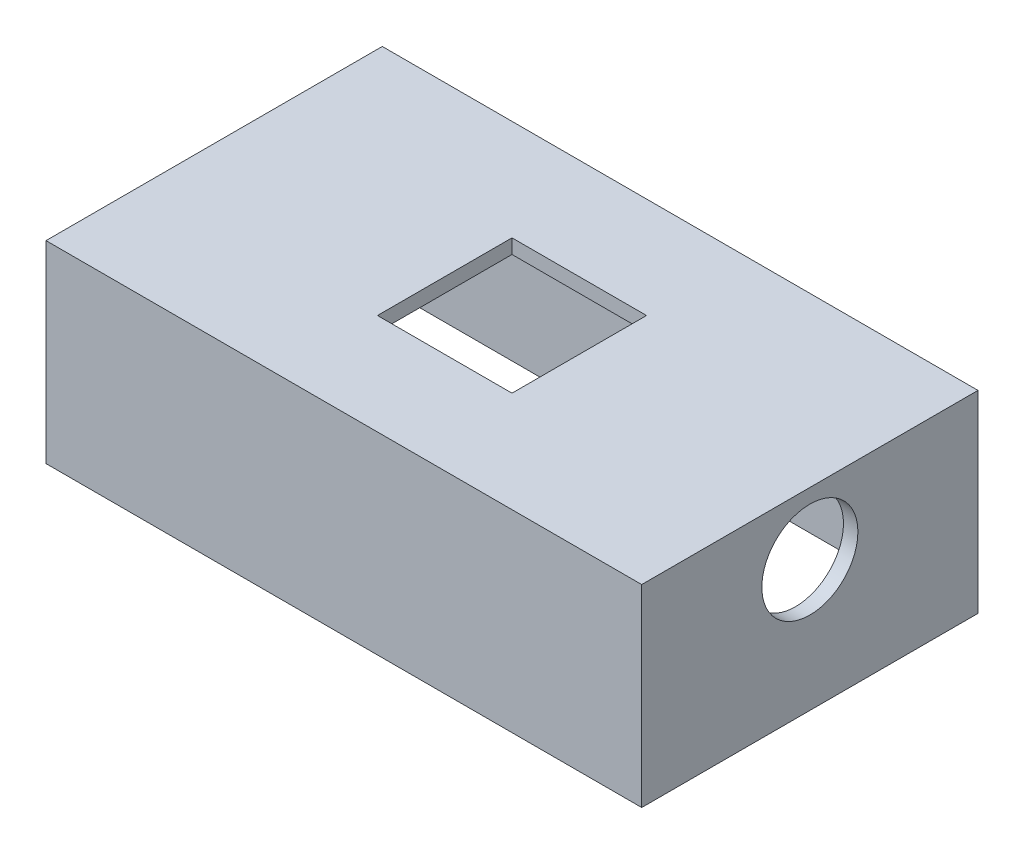
ISO-10303-21;
HEADER;
FILE_DESCRIPTION(('STEP AP214'),'2;1');
FILE_NAME('part.step','',(''),(''),'','','');
FILE_SCHEMA(('AUTOMOTIVE_DESIGN { 1 0 10303 214 1 1 1 1 }'));
ENDSEC;
DATA;
#1=APPLICATION_CONTEXT('core data for automotive mechanical design processes');
#2=APPLICATION_PROTOCOL_DEFINITION('international standard','automotive_design',2000,#1);
#3=PRODUCT_CONTEXT('',#1,'mechanical');
#4=PRODUCT('Part','Part','',(#3));
#5=PRODUCT_RELATED_PRODUCT_CATEGORY('part','',(#4));
#6=PRODUCT_DEFINITION_FORMATION('','',#4);
#7=PRODUCT_DEFINITION_CONTEXT('part definition',#1,'design');
#8=PRODUCT_DEFINITION('design','',#6,#7);
#9=PRODUCT_DEFINITION_SHAPE('','',#8);
#10=(LENGTH_UNIT() NAMED_UNIT(*) SI_UNIT(.MILLI.,.METRE.));
#11=(NAMED_UNIT(*) PLANE_ANGLE_UNIT() SI_UNIT($,.RADIAN.));
#12=(NAMED_UNIT(*) SI_UNIT($,.STERADIAN.) SOLID_ANGLE_UNIT());
#13=UNCERTAINTY_MEASURE_WITH_UNIT(LENGTH_MEASURE(1.E-05),#10,'distance_accuracy_value','');
#14=(GEOMETRIC_REPRESENTATION_CONTEXT(3) GLOBAL_UNCERTAINTY_ASSIGNED_CONTEXT((#13)) GLOBAL_UNIT_ASSIGNED_CONTEXT((#10,
#11,#12)) REPRESENTATION_CONTEXT('',''));
#15=CARTESIAN_POINT('',(0.,0.,0.));
#16=DIRECTION('',(0.,0.,1.));
#17=DIRECTION('',(1.,0.,0.));
#18=AXIS2_PLACEMENT_3D('',#15,#16,#17);
#19=CARTESIAN_POINT('',(-28.00316877496,1.5,-22.2518472906404));
#20=DIRECTION('',(1.,0.,0.));
#21=DIRECTION('',(0.,0.,-1.));
#22=AXIS2_PLACEMENT_3D('',#19,#20,#21);
#23=PLANE('',#22);
#24=DIRECTION('',(0.,-1.,0.));
#25=VECTOR('',#24,1.);
#26=CARTESIAN_POINT('',(-28.00316877496,1.5,-22.2518472906404));
#27=LINE('',#26,#25);
#28=CARTESIAN_POINT('',(-28.00316877496,4.,-22.2518472906404));
#29=VERTEX_POINT('',#28);
#30=CARTESIAN_POINT('',(-28.00316877496,-16.1,-22.2518472906404));
#31=VERTEX_POINT('',#30);
#32=EDGE_CURVE('E222',#29,#31,#27,.T.);
#33=ORIENTED_EDGE('',*,*,#32,.T.);
#34=DIRECTION('',(0.,0.,1.));
#35=VECTOR('',#34,1.);
#36=CARTESIAN_POINT('',(-28.00316877496,-16.1,-22.2518472906404));
#37=LINE('',#36,#35);
#38=CARTESIAN_POINT('',(-28.00316877496,-16.1,12.7481527093596));
#39=VERTEX_POINT('',#38);
#40=EDGE_CURVE('E219',#31,#39,#37,.T.);
#41=ORIENTED_EDGE('',*,*,#40,.T.);
#42=DIRECTION('',(0.,-1.,0.));
#43=VECTOR('',#42,1.);
#44=CARTESIAN_POINT('',(-28.00316877496,1.5,12.7481527093596));
#45=LINE('',#44,#43);
#46=CARTESIAN_POINT('',(-28.00316877496,4.,12.7481527093596));
#47=VERTEX_POINT('',#46);
#48=EDGE_CURVE('E11',#47,#39,#45,.T.);
#49=ORIENTED_EDGE('',*,*,#48,.F.);
#50=DIRECTION('',(0.,0.,1.));
#51=VECTOR('',#50,1.);
#52=CARTESIAN_POINT('',(-28.00316877496,4.,-22.2518472906404));
#53=LINE('',#52,#51);
#54=EDGE_CURVE('E176',#29,#47,#53,.T.);
#55=ORIENTED_EDGE('',*,*,#54,.F.);
#56=EDGE_LOOP('',(#33,#41,#49,#55));
#57=FACE_BOUND('',#56,.T.);
#58=ADVANCED_FACE('F35',(#57),#23,.F.);
#59=CARTESIAN_POINT('',(-28.00316877496,1.5,12.7481527093596));
#60=DIRECTION('',(0.,0.,-1.));
#61=DIRECTION('',(-1.,0.,0.));
#62=AXIS2_PLACEMENT_3D('',#59,#60,#61);
#63=PLANE('',#62);
#64=ORIENTED_EDGE('',*,*,#48,.T.);
#65=DIRECTION('',(1.,0.,0.));
#66=VECTOR('',#65,1.);
#67=CARTESIAN_POINT('',(-28.00316877496,-16.1,12.7481527093596));
#68=LINE('',#67,#66);
#69=CARTESIAN_POINT('',(33.99683122504,-16.1,12.7481527093596));
#70=VERTEX_POINT('',#69);
#71=EDGE_CURVE('E206',#39,#70,#68,.T.);
#72=ORIENTED_EDGE('',*,*,#71,.T.);
#73=DIRECTION('',(0.,-1.,0.));
#74=VECTOR('',#73,1.);
#75=CARTESIAN_POINT('',(33.99683122504,1.5,12.7481527093596));
#76=LINE('',#75,#74);
#77=CARTESIAN_POINT('',(33.99683122504,4.,12.7481527093596));
#78=VERTEX_POINT('',#77);
#79=EDGE_CURVE('E42',#78,#70,#76,.T.);
#80=ORIENTED_EDGE('',*,*,#79,.F.);
#81=DIRECTION('',(1.,0.,0.));
#82=VECTOR('',#81,1.);
#83=CARTESIAN_POINT('',(-28.00316877496,4.,12.7481527093596));
#84=LINE('',#83,#82);
#85=EDGE_CURVE('E165',#47,#78,#84,.T.);
#86=ORIENTED_EDGE('',*,*,#85,.F.);
#87=EDGE_LOOP('',(#64,#72,#80,#86));
#88=FACE_BOUND('',#87,.T.);
#89=ADVANCED_FACE('F238',(#88),#63,.F.);
#90=CARTESIAN_POINT('',(33.99683122504,1.5,-22.2518472906404));
#91=DIRECTION('',(-1.,0.,0.));
#92=DIRECTION('',(0.,0.,1.));
#93=AXIS2_PLACEMENT_3D('',#90,#91,#92);
#94=PLANE('',#93);
#95=CARTESIAN_POINT('',(33.99683122504,-2.5,-4.75184729064038));
#96=DIRECTION('',(1.,0.,0.));
#97=DIRECTION('',(0.,0.,-1.));
#98=AXIS2_PLACEMENT_3D('',#95,#96,#97);
#99=CIRCLE('',#98,5.);
#100=CARTESIAN_POINT('',(33.99683122504,-2.5,-9.75184729064038));
#101=VERTEX_POINT('',#100);
#102=EDGE_CURVE('E139',#101,#101,#99,.T.);
#103=ORIENTED_EDGE('',*,*,#102,.F.);
#104=EDGE_LOOP('',(#103));
#105=FACE_BOUND('',#104,.T.);
#106=ORIENTED_EDGE('',*,*,#79,.T.);
#107=DIRECTION('',(0.,0.,-1.));
#108=VECTOR('',#107,1.);
#109=CARTESIAN_POINT('',(33.99683122504,-16.1,12.7481527093596));
#110=LINE('',#109,#108);
#111=CARTESIAN_POINT('',(33.99683122504,-16.1,-22.2518472906404));
#112=VERTEX_POINT('',#111);
#113=EDGE_CURVE('E213',#70,#112,#110,.T.);
#114=ORIENTED_EDGE('',*,*,#113,.T.);
#115=DIRECTION('',(0.,-1.,0.));
#116=VECTOR('',#115,1.);
#117=CARTESIAN_POINT('',(33.99683122504,1.5,-22.2518472906404));
#118=LINE('',#117,#116);
#119=CARTESIAN_POINT('',(33.99683122504,4.,-22.2518472906404));
#120=VERTEX_POINT('',#119);
#121=EDGE_CURVE('E226',#120,#112,#118,.T.);
#122=ORIENTED_EDGE('',*,*,#121,.F.);
#123=DIRECTION('',(0.,0.,-1.));
#124=VECTOR('',#123,1.);
#125=CARTESIAN_POINT('',(33.99683122504,4.,12.7481527093596));
#126=LINE('',#125,#124);
#127=EDGE_CURVE('E170',#78,#120,#126,.T.);
#128=ORIENTED_EDGE('',*,*,#127,.F.);
#129=EDGE_LOOP('',(#106,#114,#122,#128));
#130=FACE_BOUND('',#129,.T.);
#131=ADVANCED_FACE('F230',(#105,#130),#94,.F.);
#132=CARTESIAN_POINT('',(-28.00316877496,1.5,-22.2518472906404));
#133=DIRECTION('',(0.,0.,1.));
#134=DIRECTION('',(1.,0.,0.));
#135=AXIS2_PLACEMENT_3D('',#132,#133,#134);
#136=PLANE('',#135);
#137=ORIENTED_EDGE('',*,*,#121,.T.);
#138=DIRECTION('',(-1.,0.,0.));
#139=VECTOR('',#138,1.);
#140=CARTESIAN_POINT('',(33.99683122504,-16.1,-22.2518472906404));
#141=LINE('',#140,#139);
#142=EDGE_CURVE('E216',#112,#31,#141,.T.);
#143=ORIENTED_EDGE('',*,*,#142,.T.);
#144=ORIENTED_EDGE('',*,*,#32,.F.);
#145=DIRECTION('',(-1.,0.,0.));
#146=VECTOR('',#145,1.);
#147=CARTESIAN_POINT('',(33.99683122504,4.,-22.2518472906404));
#148=LINE('',#147,#146);
#149=EDGE_CURVE('E173',#120,#29,#148,.T.);
#150=ORIENTED_EDGE('',*,*,#149,.F.);
#151=EDGE_LOOP('',(#137,#143,#144,#150));
#152=FACE_BOUND('',#151,.T.);
#153=ADVANCED_FACE('F245',(#152),#136,.F.);
#154=CARTESIAN_POINT('',(-0.865067631516461,-16.1,-9.28617348339548));
#155=DIRECTION('',(0.,1.,0.));
#156=DIRECTION('',(0.,0.,1.));
#157=AXIS2_PLACEMENT_3D('',#154,#155,#156);
#158=PLANE('',#157);
#159=DIRECTION('',(0.,0.,1.));
#160=VECTOR('',#159,1.);
#161=CARTESIAN_POINT('',(32.49683122504,-16.1,-20.7518472906401));
#162=LINE('',#161,#160);
#163=CARTESIAN_POINT('',(32.49683122504,-16.1,-20.7518472906401));
#164=VERTEX_POINT('',#163);
#165=CARTESIAN_POINT('',(32.4968312250401,-16.1,11.2481527093599));
#166=VERTEX_POINT('',#165);
#167=EDGE_CURVE('E194',#164,#166,#162,.T.);
#168=ORIENTED_EDGE('',*,*,#167,.F.);
#169=DIRECTION('',(1.,0.,0.));
#170=VECTOR('',#169,1.);
#171=CARTESIAN_POINT('',(-26.50316877496,-16.1,-20.7518472906401));
#172=LINE('',#171,#170);
#173=CARTESIAN_POINT('',(-26.50316877496,-16.1,-20.7518472906401));
#174=VERTEX_POINT('',#173);
#175=EDGE_CURVE('E192',#174,#164,#172,.T.);
#176=ORIENTED_EDGE('',*,*,#175,.F.);
#177=DIRECTION('',(0.,0.,-1.));
#178=VECTOR('',#177,1.);
#179=CARTESIAN_POINT('',(-26.50316877496,-16.1,11.2481527093599));
#180=LINE('',#179,#178);
#181=CARTESIAN_POINT('',(-26.50316877496,-16.1,11.2481527093599));
#182=VERTEX_POINT('',#181);
#183=EDGE_CURVE('E200',#182,#174,#180,.T.);
#184=ORIENTED_EDGE('',*,*,#183,.F.);
#185=DIRECTION('',(-1.,0.,0.));
#186=VECTOR('',#185,1.);
#187=CARTESIAN_POINT('',(32.4968312250401,-16.1,11.2481527093599));
#188=LINE('',#187,#186);
#189=EDGE_CURVE('E197',#166,#182,#188,.T.);
#190=ORIENTED_EDGE('',*,*,#189,.F.);
#191=EDGE_LOOP('',(#168,#176,#184,#190));
#192=FACE_BOUND('',#191,.T.);
#193=ORIENTED_EDGE('',*,*,#142,.F.);
#194=ORIENTED_EDGE('',*,*,#113,.F.);
#195=ORIENTED_EDGE('',*,*,#71,.F.);
#196=ORIENTED_EDGE('',*,*,#40,.F.);
#197=EDGE_LOOP('',(#193,#194,#195,#196));
#198=FACE_BOUND('',#197,.T.);
#199=ADVANCED_FACE('F236',(#192,#198),#158,.F.);
#200=CARTESIAN_POINT('',(-26.50316877496,24.9,-20.7518472906401));
#201=DIRECTION('',(0.,0.,-1.));
#202=DIRECTION('',(-1.,0.,0.));
#203=AXIS2_PLACEMENT_3D('',#200,#201,#202);
#204=PLANE('',#203);
#205=DIRECTION('',(0.,-1.,0.));
#206=VECTOR('',#205,1.);
#207=CARTESIAN_POINT('',(32.49683122504,24.9,-20.7518472906401));
#208=LINE('',#207,#206);
#209=CARTESIAN_POINT('',(32.49683122504,2.5,-20.7518472906401));
#210=VERTEX_POINT('',#209);
#211=EDGE_CURVE('E203',#210,#164,#208,.T.);
#212=ORIENTED_EDGE('',*,*,#211,.F.);
#213=DIRECTION('',(-1.,0.,0.));
#214=VECTOR('',#213,1.);
#215=CARTESIAN_POINT('',(32.49683122504,2.5,-20.7518472906401));
#216=LINE('',#215,#214);
#217=CARTESIAN_POINT('',(-26.50316877496,2.5,-20.7518472906401));
#218=VERTEX_POINT('',#217);
#219=EDGE_CURVE('E189',#210,#218,#216,.T.);
#220=ORIENTED_EDGE('',*,*,#219,.T.);
#221=DIRECTION('',(0.,-1.,0.));
#222=VECTOR('',#221,1.);
#223=CARTESIAN_POINT('',(-26.50316877496,24.9,-20.7518472906401));
#224=LINE('',#223,#222);
#225=EDGE_CURVE('E204',#218,#174,#224,.T.);
#226=ORIENTED_EDGE('',*,*,#225,.T.);
#227=ORIENTED_EDGE('',*,*,#175,.T.);
#228=EDGE_LOOP('',(#212,#220,#226,#227));
#229=FACE_BOUND('',#228,.T.);
#230=ADVANCED_FACE('F252',(#229),#204,.F.);
#231=CARTESIAN_POINT('',(-26.50316877496,24.9,11.2481527093599));
#232=DIRECTION('',(-1.,0.,0.));
#233=DIRECTION('',(0.,0.,1.));
#234=AXIS2_PLACEMENT_3D('',#231,#232,#233);
#235=PLANE('',#234);
#236=ORIENTED_EDGE('',*,*,#225,.F.);
#237=DIRECTION('',(0.,0.,1.));
#238=VECTOR('',#237,1.);
#239=CARTESIAN_POINT('',(-26.50316877496,2.5,-20.7518472906401));
#240=LINE('',#239,#238);
#241=CARTESIAN_POINT('',(-26.50316877496,2.5,11.2481527093599));
#242=VERTEX_POINT('',#241);
#243=EDGE_CURVE('E179',#218,#242,#240,.T.);
#244=ORIENTED_EDGE('',*,*,#243,.T.);
#245=DIRECTION('',(0.,-1.,0.));
#246=VECTOR('',#245,1.);
#247=CARTESIAN_POINT('',(-26.50316877496,24.9,11.2481527093599));
#248=LINE('',#247,#246);
#249=EDGE_CURVE('E207',#242,#182,#248,.T.);
#250=ORIENTED_EDGE('',*,*,#249,.T.);
#251=ORIENTED_EDGE('',*,*,#183,.T.);
#252=EDGE_LOOP('',(#236,#244,#250,#251));
#253=FACE_BOUND('',#252,.T.);
#254=ADVANCED_FACE('F354',(#253),#235,.F.);
#255=CARTESIAN_POINT('',(32.4968312250401,24.9,11.2481527093599));
#256=DIRECTION('',(0.,0.,1.));
#257=DIRECTION('',(1.,0.,0.));
#258=AXIS2_PLACEMENT_3D('',#255,#256,#257);
#259=PLANE('',#258);
#260=ORIENTED_EDGE('',*,*,#249,.F.);
#261=DIRECTION('',(1.,0.,0.));
#262=VECTOR('',#261,1.);
#263=CARTESIAN_POINT('',(-26.50316877496,2.5,11.2481527093599));
#264=LINE('',#263,#262);
#265=CARTESIAN_POINT('',(32.4968312250401,2.5,11.2481527093599));
#266=VERTEX_POINT('',#265);
#267=EDGE_CURVE('E182',#242,#266,#264,.T.);
#268=ORIENTED_EDGE('',*,*,#267,.T.);
#269=DIRECTION('',(0.,-1.,0.));
#270=VECTOR('',#269,1.);
#271=CARTESIAN_POINT('',(32.4968312250401,24.9,11.2481527093599));
#272=LINE('',#271,#270);
#273=EDGE_CURVE('E209',#266,#166,#272,.T.);
#274=ORIENTED_EDGE('',*,*,#273,.T.);
#275=ORIENTED_EDGE('',*,*,#189,.T.);
#276=EDGE_LOOP('',(#260,#268,#274,#275));
#277=FACE_BOUND('',#276,.T.);
#278=ADVANCED_FACE('F275',(#277),#259,.F.);
#279=CARTESIAN_POINT('',(32.49683122504,24.9,-20.7518472906401));
#280=DIRECTION('',(1.,0.,0.));
#281=DIRECTION('',(0.,0.,-1.));
#282=AXIS2_PLACEMENT_3D('',#279,#280,#281);
#283=PLANE('',#282);
#284=DIRECTION('',(0.,0.,-1.));
#285=VECTOR('',#284,1.);
#286=CARTESIAN_POINT('',(32.4968312250401,2.5,11.2481527093599));
#287=LINE('',#286,#285);
#288=CARTESIAN_POINT('',(32.49683122504,2.5,-4.75184729064038));
#289=VERTEX_POINT('',#288);
#290=EDGE_CURVE('E186',#266,#289,#287,.T.);
#291=ORIENTED_EDGE('',*,*,#290,.T.);
#292=CARTESIAN_POINT('',(32.49683122504,-2.5,-4.75184729064038));
#293=DIRECTION('',(1.,0.,0.));
#294=DIRECTION('',(0.,0.,-1.));
#295=AXIS2_PLACEMENT_3D('',#292,#293,#294);
#296=CIRCLE('',#295,5.);
#297=EDGE_CURVE('E162',#289,#289,#296,.T.);
#298=ORIENTED_EDGE('',*,*,#297,.T.);
#299=EDGE_CURVE('E185',#289,#210,#287,.T.);
#300=ORIENTED_EDGE('',*,*,#299,.T.);
#301=ORIENTED_EDGE('',*,*,#211,.T.);
#302=ORIENTED_EDGE('',*,*,#167,.T.);
#303=ORIENTED_EDGE('',*,*,#273,.F.);
#304=EDGE_LOOP('',(#291,#298,#300,#301,#302,#303));
#305=FACE_BOUND('',#304,.T.);
#306=ADVANCED_FACE('F280',(#305),#283,.F.);
#307=CARTESIAN_POINT('',(0.,2.5,0.));
#308=DIRECTION('',(0.,1.,0.));
#309=DIRECTION('',(0.,0.,1.));
#310=AXIS2_PLACEMENT_3D('',#307,#308,#309);
#311=PLANE('',#310);
#312=DIRECTION('',(1.,0.,0.));
#313=VECTOR('',#312,1.);
#314=CARTESIAN_POINT('',(-4.00316877495997,2.5,-11.7518472906404));
#315=LINE('',#314,#313);
#316=CARTESIAN_POINT('',(-4.00316877495997,2.5,-11.7518472906404));
#317=VERTEX_POINT('',#316);
#318=CARTESIAN_POINT('',(9.99683122504003,2.5,-11.7518472906404));
#319=VERTEX_POINT('',#318);
#320=EDGE_CURVE('E145',#317,#319,#315,.T.);
#321=ORIENTED_EDGE('',*,*,#320,.F.);
#322=DIRECTION('',(0.,0.,-1.));
#323=VECTOR('',#322,1.);
#324=CARTESIAN_POINT('',(-4.00316877495997,2.5,-11.7518472906404));
#325=LINE('',#324,#323);
#326=CARTESIAN_POINT('',(-4.00316877495997,2.5,2.24815270935962));
#327=VERTEX_POINT('',#326);
#328=EDGE_CURVE('E127',#327,#317,#325,.T.);
#329=ORIENTED_EDGE('',*,*,#328,.F.);
#330=DIRECTION('',(-1.,0.,0.));
#331=VECTOR('',#330,1.);
#332=CARTESIAN_POINT('',(-4.00316877495997,2.5,2.24815270935962));
#333=LINE('',#332,#331);
#334=CARTESIAN_POINT('',(9.99683122504003,2.5,2.24815270935962));
#335=VERTEX_POINT('',#334);
#336=EDGE_CURVE('E136',#335,#327,#333,.T.);
#337=ORIENTED_EDGE('',*,*,#336,.F.);
#338=DIRECTION('',(0.,0.,1.));
#339=VECTOR('',#338,1.);
#340=CARTESIAN_POINT('',(9.99683122504003,2.5,-11.7518472906404));
#341=LINE('',#340,#339);
#342=EDGE_CURVE('E49',#319,#335,#341,.T.);
#343=ORIENTED_EDGE('',*,*,#342,.F.);
#344=EDGE_LOOP('',(#321,#329,#337,#343));
#345=FACE_BOUND('',#344,.T.);
#346=ORIENTED_EDGE('',*,*,#267,.F.);
#347=ORIENTED_EDGE('',*,*,#243,.F.);
#348=ORIENTED_EDGE('',*,*,#219,.F.);
#349=ORIENTED_EDGE('',*,*,#299,.F.);
#350=ORIENTED_EDGE('',*,*,#290,.F.);
#351=EDGE_LOOP('',(#346,#347,#348,#349,#350));
#352=FACE_BOUND('',#351,.T.);
#353=ADVANCED_FACE('F142',(#345,#352),#311,.F.);
#354=CARTESIAN_POINT('',(0.,4.,0.));
#355=DIRECTION('',(0.,1.,0.));
#356=DIRECTION('',(0.,0.,1.));
#357=AXIS2_PLACEMENT_3D('',#354,#355,#356);
#358=PLANE('',#357);
#359=DIRECTION('',(0.,0.,1.));
#360=VECTOR('',#359,1.);
#361=CARTESIAN_POINT('',(-4.00316877495997,4.,-11.7518472906404));
#362=LINE('',#361,#360);
#363=CARTESIAN_POINT('',(-4.00316877495997,4.,-11.7518472906404));
#364=VERTEX_POINT('',#363);
#365=CARTESIAN_POINT('',(-4.00316877495997,4.,2.24815270935962));
#366=VERTEX_POINT('',#365);
#367=EDGE_CURVE('E57',#364,#366,#362,.T.);
#368=ORIENTED_EDGE('',*,*,#367,.F.);
#369=DIRECTION('',(-1.,0.,0.));
#370=VECTOR('',#369,1.);
#371=CARTESIAN_POINT('',(-4.00316877495997,4.,-11.7518472906404));
#372=LINE('',#371,#370);
#373=CARTESIAN_POINT('',(9.99683122504003,4.,-11.7518472906404));
#374=VERTEX_POINT('',#373);
#375=EDGE_CURVE('E133',#374,#364,#372,.T.);
#376=ORIENTED_EDGE('',*,*,#375,.F.);
#377=DIRECTION('',(0.,0.,-1.));
#378=VECTOR('',#377,1.);
#379=CARTESIAN_POINT('',(9.99683122504003,4.,-11.7518472906404));
#380=LINE('',#379,#378);
#381=CARTESIAN_POINT('',(9.99683122504003,4.,2.24815270935962));
#382=VERTEX_POINT('',#381);
#383=EDGE_CURVE('E153',#382,#374,#380,.T.);
#384=ORIENTED_EDGE('',*,*,#383,.F.);
#385=DIRECTION('',(1.,0.,0.));
#386=VECTOR('',#385,1.);
#387=CARTESIAN_POINT('',(-4.00316877495997,4.,2.24815270935962));
#388=LINE('',#387,#386);
#389=EDGE_CURVE('E147',#366,#382,#388,.T.);
#390=ORIENTED_EDGE('',*,*,#389,.F.);
#391=EDGE_LOOP('',(#368,#376,#384,#390));
#392=FACE_BOUND('',#391,.T.);
#393=ORIENTED_EDGE('',*,*,#85,.T.);
#394=ORIENTED_EDGE('',*,*,#127,.T.);
#395=ORIENTED_EDGE('',*,*,#149,.T.);
#396=ORIENTED_EDGE('',*,*,#54,.T.);
#397=EDGE_LOOP('',(#393,#394,#395,#396));
#398=FACE_BOUND('',#397,.T.);
#399=ADVANCED_FACE('F242',(#392,#398),#358,.T.);
#400=CARTESIAN_POINT('',(32.49683122504,-2.5,-4.75184729064038));
#401=DIRECTION('',(1.,0.,0.));
#402=DIRECTION('',(0.,0.,-1.));
#403=AXIS2_PLACEMENT_3D('',#400,#401,#402);
#404=CYLINDRICAL_SURFACE('',#403,5.);
#405=ORIENTED_EDGE('',*,*,#297,.F.);
#406=EDGE_LOOP('',(#405));
#407=FACE_BOUND('',#406,.T.);
#408=ORIENTED_EDGE('',*,*,#102,.T.);
#409=EDGE_LOOP('',(#408));
#410=FACE_BOUND('',#409,.T.);
#411=ADVANCED_FACE('F293',(#407,#410),#404,.F.);
#412=CARTESIAN_POINT('',(-4.00316877495997,-16.101,-11.7518472906404));
#413=DIRECTION('',(-1.,0.,0.));
#414=DIRECTION('',(0.,0.,1.));
#415=AXIS2_PLACEMENT_3D('',#412,#413,#414);
#416=PLANE('',#415);
#417=ORIENTED_EDGE('',*,*,#328,.T.);
#418=DIRECTION('',(0.,1.,0.));
#419=VECTOR('',#418,1.);
#420=CARTESIAN_POINT('',(-4.00316877495997,-16.101,-11.7518472906404));
#421=LINE('',#420,#419);
#422=EDGE_CURVE('E140',#317,#364,#421,.T.);
#423=ORIENTED_EDGE('',*,*,#422,.T.);
#424=ORIENTED_EDGE('',*,*,#367,.T.);
#425=DIRECTION('',(0.,1.,0.));
#426=VECTOR('',#425,1.);
#427=CARTESIAN_POINT('',(-4.00316877495997,-16.101,2.24815270935962));
#428=LINE('',#427,#426);
#429=EDGE_CURVE('E123',#327,#366,#428,.T.);
#430=ORIENTED_EDGE('',*,*,#429,.F.);
#431=EDGE_LOOP('',(#417,#423,#424,#430));
#432=FACE_BOUND('',#431,.T.);
#433=ADVANCED_FACE('F125',(#432),#416,.F.);
#434=CARTESIAN_POINT('',(-4.00316877495997,-16.101,-11.7518472906404));
#435=DIRECTION('',(0.,0.,-1.));
#436=DIRECTION('',(-1.,0.,0.));
#437=AXIS2_PLACEMENT_3D('',#434,#435,#436);
#438=PLANE('',#437);
#439=ORIENTED_EDGE('',*,*,#320,.T.);
#440=DIRECTION('',(0.,1.,0.));
#441=VECTOR('',#440,1.);
#442=CARTESIAN_POINT('',(9.99683122504003,-16.101,-11.7518472906404));
#443=LINE('',#442,#441);
#444=EDGE_CURVE('E159',#319,#374,#443,.T.);
#445=ORIENTED_EDGE('',*,*,#444,.T.);
#446=ORIENTED_EDGE('',*,*,#375,.T.);
#447=ORIENTED_EDGE('',*,*,#422,.F.);
#448=EDGE_LOOP('',(#439,#445,#446,#447));
#449=FACE_BOUND('',#448,.T.);
#450=ADVANCED_FACE('F323',(#449),#438,.F.);
#451=CARTESIAN_POINT('',(9.99683122504003,-16.101,-11.7518472906404));
#452=DIRECTION('',(1.,0.,0.));
#453=DIRECTION('',(0.,0.,-1.));
#454=AXIS2_PLACEMENT_3D('',#451,#452,#453);
#455=PLANE('',#454);
#456=ORIENTED_EDGE('',*,*,#342,.T.);
#457=DIRECTION('',(0.,1.,0.));
#458=VECTOR('',#457,1.);
#459=CARTESIAN_POINT('',(9.99683122504003,-16.101,2.24815270935962));
#460=LINE('',#459,#458);
#461=EDGE_CURVE('E132',#335,#382,#460,.T.);
#462=ORIENTED_EDGE('',*,*,#461,.T.);
#463=ORIENTED_EDGE('',*,*,#383,.T.);
#464=ORIENTED_EDGE('',*,*,#444,.F.);
#465=EDGE_LOOP('',(#456,#462,#463,#464));
#466=FACE_BOUND('',#465,.T.);
#467=ADVANCED_FACE('F332',(#466),#455,.F.);
#468=CARTESIAN_POINT('',(-4.00316877495997,-16.101,2.24815270935962));
#469=DIRECTION('',(0.,0.,1.));
#470=DIRECTION('',(1.,0.,0.));
#471=AXIS2_PLACEMENT_3D('',#468,#469,#470);
#472=PLANE('',#471);
#473=ORIENTED_EDGE('',*,*,#336,.T.);
#474=ORIENTED_EDGE('',*,*,#429,.T.);
#475=ORIENTED_EDGE('',*,*,#389,.T.);
#476=ORIENTED_EDGE('',*,*,#461,.F.);
#477=EDGE_LOOP('',(#473,#474,#475,#476));
#478=FACE_BOUND('',#477,.T.);
#479=ADVANCED_FACE('F137',(#478),#472,.F.);
#480=CLOSED_SHELL('',(#58,#89,#131,#153,#199,#230,#254,#278,#306,#353,#399,#411,#433,#450,#467,#479));
#481=MANIFOLD_SOLID_BREP('B2',#480);
#482=ADVANCED_BREP_SHAPE_REPRESENTATION('',(#18,#481),#14);
#483=SHAPE_DEFINITION_REPRESENTATION(#9,#482);
ENDSEC;
END-ISO-10303-21;
